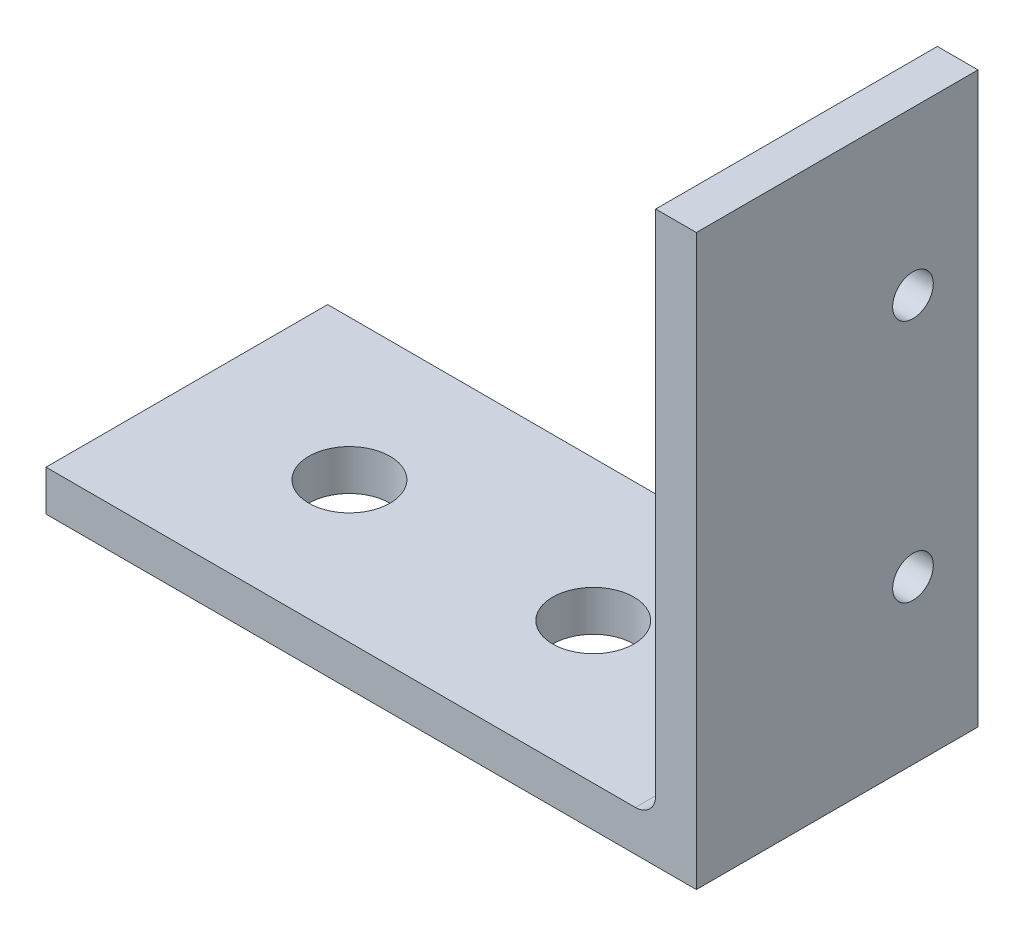
ISO-10303-21;
HEADER;
FILE_DESCRIPTION(('STEP AP214'),'2;1');
FILE_NAME('part.step','',(''),(''),'','','');
FILE_SCHEMA(('AUTOMOTIVE_DESIGN { 1 0 10303 214 1 1 1 1 }'));
ENDSEC;
DATA;
#1=APPLICATION_CONTEXT('core data for automotive mechanical design processes');
#2=APPLICATION_PROTOCOL_DEFINITION('international standard','automotive_design',2000,#1);
#3=PRODUCT_CONTEXT('',#1,'mechanical');
#4=PRODUCT('Part','Part','',(#3));
#5=PRODUCT_RELATED_PRODUCT_CATEGORY('part','',(#4));
#6=PRODUCT_DEFINITION_FORMATION('','',#4);
#7=PRODUCT_DEFINITION_CONTEXT('part definition',#1,'design');
#8=PRODUCT_DEFINITION('design','',#6,#7);
#9=PRODUCT_DEFINITION_SHAPE('','',#8);
#10=(LENGTH_UNIT() NAMED_UNIT(*) SI_UNIT(.MILLI.,.METRE.));
#11=(NAMED_UNIT(*) PLANE_ANGLE_UNIT() SI_UNIT($,.RADIAN.));
#12=(NAMED_UNIT(*) SI_UNIT($,.STERADIAN.) SOLID_ANGLE_UNIT());
#13=UNCERTAINTY_MEASURE_WITH_UNIT(LENGTH_MEASURE(1.E-05),#10,'distance_accuracy_value','');
#14=(GEOMETRIC_REPRESENTATION_CONTEXT(3) GLOBAL_UNCERTAINTY_ASSIGNED_CONTEXT((#13)) GLOBAL_UNIT_ASSIGNED_CONTEXT((#10,
#11,#12)) REPRESENTATION_CONTEXT('',''));
#15=CARTESIAN_POINT('',(0.,0.,0.));
#16=DIRECTION('',(0.,0.,1.));
#17=DIRECTION('',(1.,0.,0.));
#18=AXIS2_PLACEMENT_3D('',#15,#16,#17);
#19=CARTESIAN_POINT('',(-25.4,0.,11.));
#20=DIRECTION('',(1.,0.,0.));
#21=DIRECTION('',(0.,1.,0.));
#22=AXIS2_PLACEMENT_3D('',#19,#20,#21);
#23=PLANE('',#22);
#24=DIRECTION('',(0.,-1.,0.));
#25=VECTOR('',#24,1.);
#26=CARTESIAN_POINT('',(-25.4,0.,-11.));
#27=LINE('',#26,#25);
#28=CARTESIAN_POINT('',(-25.4,3.175,-11.));
#29=VERTEX_POINT('',#28);
#30=CARTESIAN_POINT('',(-25.4,0.,-11.));
#31=VERTEX_POINT('',#30);
#32=EDGE_CURVE('E116',#29,#31,#27,.T.);
#33=ORIENTED_EDGE('',*,*,#32,.T.);
#34=DIRECTION('',(0.,0.,-1.));
#35=VECTOR('',#34,1.);
#36=CARTESIAN_POINT('',(-25.4,0.,11.));
#37=LINE('',#36,#35);
#38=CARTESIAN_POINT('',(-25.4,0.,11.));
#39=VERTEX_POINT('',#38);
#40=EDGE_CURVE('E134',#39,#31,#37,.T.);
#41=ORIENTED_EDGE('',*,*,#40,.F.);
#42=DIRECTION('',(0.,-1.,0.));
#43=VECTOR('',#42,1.);
#44=CARTESIAN_POINT('',(-25.4,0.,11.));
#45=LINE('',#44,#43);
#46=CARTESIAN_POINT('',(-25.4,3.175,11.));
#47=VERTEX_POINT('',#46);
#48=EDGE_CURVE('E128',#47,#39,#45,.T.);
#49=ORIENTED_EDGE('',*,*,#48,.F.);
#50=DIRECTION('',(0.,0.,-1.));
#51=VECTOR('',#50,1.);
#52=CARTESIAN_POINT('',(-25.4,3.175,11.));
#53=LINE('',#52,#51);
#54=EDGE_CURVE('E110',#47,#29,#53,.T.);
#55=ORIENTED_EDGE('',*,*,#54,.T.);
#56=EDGE_LOOP('',(#33,#41,#49,#55));
#57=FACE_BOUND('',#56,.T.);
#58=ADVANCED_FACE('F33',(#57),#23,.F.);
#59=CARTESIAN_POINT('',(-25.4,0.,11.));
#60=DIRECTION('',(0.,1.,0.));
#61=DIRECTION('',(0.,0.,1.));
#62=AXIS2_PLACEMENT_3D('',#59,#60,#61);
#63=PLANE('',#62);
#64=CARTESIAN_POINT('',(-12.7,0.,0.));
#65=DIRECTION('',(0.,-1.,0.));
#66=DIRECTION('',(0.,0.,-1.));
#67=AXIS2_PLACEMENT_3D('',#64,#65,#66);
#68=CIRCLE('',#67,3.175);
#69=CARTESIAN_POINT('',(-12.7,0.,-3.175));
#70=VERTEX_POINT('',#69);
#71=EDGE_CURVE('E148',#70,#70,#68,.T.);
#72=ORIENTED_EDGE('',*,*,#71,.F.);
#73=EDGE_LOOP('',(#72));
#74=FACE_BOUND('',#73,.T.);
#75=CARTESIAN_POINT('',(6.35,0.,0.));
#76=DIRECTION('',(0.,-1.,0.));
#77=DIRECTION('',(0.,0.,-1.));
#78=AXIS2_PLACEMENT_3D('',#75,#76,#77);
#79=CIRCLE('',#78,3.175);
#80=CARTESIAN_POINT('',(6.35,0.,-3.175));
#81=VERTEX_POINT('',#80);
#82=EDGE_CURVE('E156',#81,#81,#79,.T.);
#83=ORIENTED_EDGE('',*,*,#82,.F.);
#84=EDGE_LOOP('',(#83));
#85=FACE_BOUND('',#84,.T.);
#86=DIRECTION('',(1.,0.,0.));
#87=VECTOR('',#86,1.);
#88=CARTESIAN_POINT('',(-25.4,0.,-11.));
#89=LINE('',#88,#87);
#90=CARTESIAN_POINT('',(25.4,0.,-11.));
#91=VERTEX_POINT('',#90);
#92=EDGE_CURVE('E119',#31,#91,#89,.T.);
#93=ORIENTED_EDGE('',*,*,#92,.T.);
#94=DIRECTION('',(0.,0.,-1.));
#95=VECTOR('',#94,1.);
#96=CARTESIAN_POINT('',(25.4,0.,11.));
#97=LINE('',#96,#95);
#98=CARTESIAN_POINT('',(25.4,0.,11.));
#99=VERTEX_POINT('',#98);
#100=EDGE_CURVE('E131',#99,#91,#97,.T.);
#101=ORIENTED_EDGE('',*,*,#100,.F.);
#102=DIRECTION('',(1.,0.,0.));
#103=VECTOR('',#102,1.);
#104=CARTESIAN_POINT('',(-25.4,0.,11.));
#105=LINE('',#104,#103);
#106=EDGE_CURVE('E112',#39,#99,#105,.T.);
#107=ORIENTED_EDGE('',*,*,#106,.F.);
#108=ORIENTED_EDGE('',*,*,#40,.T.);
#109=EDGE_LOOP('',(#93,#101,#107,#108));
#110=FACE_BOUND('',#109,.T.);
#111=ADVANCED_FACE('F175',(#74,#85,#110),#63,.F.);
#112=CARTESIAN_POINT('',(25.4,0.,11.));
#113=DIRECTION('',(-1.,0.,0.));
#114=DIRECTION('',(0.,0.,1.));
#115=AXIS2_PLACEMENT_3D('',#112,#113,#114);
#116=PLANE('',#115);
#117=CARTESIAN_POINT('',(25.4,12.6999999999999,-5.92));
#118=DIRECTION('',(1.,0.,0.));
#119=DIRECTION('',(0.,0.,-1.));
#120=AXIS2_PLACEMENT_3D('',#117,#118,#119);
#121=CIRCLE('',#120,1.5875);
#122=CARTESIAN_POINT('',(25.4,12.6999999999999,-7.5075));
#123=VERTEX_POINT('',#122);
#124=EDGE_CURVE('E152',#123,#123,#121,.T.);
#125=ORIENTED_EDGE('',*,*,#124,.F.);
#126=EDGE_LOOP('',(#125));
#127=FACE_BOUND('',#126,.T.);
#128=CARTESIAN_POINT('',(25.4,31.75,-5.92));
#129=DIRECTION('',(1.,0.,0.));
#130=DIRECTION('',(0.,0.,-1.));
#131=AXIS2_PLACEMENT_3D('',#128,#129,#130);
#132=CIRCLE('',#131,1.5875);
#133=CARTESIAN_POINT('',(25.4,31.75,-7.5075));
#134=VERTEX_POINT('',#133);
#135=EDGE_CURVE('E158',#134,#134,#132,.T.);
#136=ORIENTED_EDGE('',*,*,#135,.F.);
#137=EDGE_LOOP('',(#136));
#138=FACE_BOUND('',#137,.T.);
#139=DIRECTION('',(0.,1.,0.));
#140=VECTOR('',#139,1.);
#141=CARTESIAN_POINT('',(25.4,0.,-11.));
#142=LINE('',#141,#140);
#143=CARTESIAN_POINT('',(25.4,44.45,-11.));
#144=VERTEX_POINT('',#143);
#145=EDGE_CURVE('E121',#91,#144,#142,.T.);
#146=ORIENTED_EDGE('',*,*,#145,.T.);
#147=DIRECTION('',(0.,0.,1.));
#148=VECTOR('',#147,1.);
#149=CARTESIAN_POINT('',(25.4,44.45,11.));
#150=LINE('',#149,#148);
#151=CARTESIAN_POINT('',(25.4,44.45,11.));
#152=VERTEX_POINT('',#151);
#153=EDGE_CURVE('E50',#144,#152,#150,.T.);
#154=ORIENTED_EDGE('',*,*,#153,.T.);
#155=DIRECTION('',(0.,1.,0.));
#156=VECTOR('',#155,1.);
#157=CARTESIAN_POINT('',(25.4,0.,11.));
#158=LINE('',#157,#156);
#159=EDGE_CURVE('E101',#99,#152,#158,.T.);
#160=ORIENTED_EDGE('',*,*,#159,.F.);
#161=ORIENTED_EDGE('',*,*,#100,.T.);
#162=EDGE_LOOP('',(#146,#154,#160,#161));
#163=FACE_BOUND('',#162,.T.);
#164=ADVANCED_FACE('F178',(#127,#138,#163),#116,.F.);
#165=CARTESIAN_POINT('',(22.225,50.8,11.));
#166=DIRECTION('',(1.,0.,0.));
#167=DIRECTION('',(0.,1.,0.));
#168=AXIS2_PLACEMENT_3D('',#165,#166,#167);
#169=PLANE('',#168);
#170=CARTESIAN_POINT('',(22.225,12.6999999999999,-5.92));
#171=DIRECTION('',(1.,0.,0.));
#172=DIRECTION('',(0.,1.,0.));
#173=AXIS2_PLACEMENT_3D('',#170,#171,#172);
#174=CIRCLE('',#173,1.5875);
#175=CARTESIAN_POINT('',(22.225,14.2874999999999,-5.92));
#176=VERTEX_POINT('',#175);
#177=EDGE_CURVE('E37',#176,#176,#174,.T.);
#178=ORIENTED_EDGE('',*,*,#177,.T.);
#179=EDGE_LOOP('',(#178));
#180=FACE_BOUND('',#179,.T.);
#181=CARTESIAN_POINT('',(22.225,31.75,-5.92));
#182=DIRECTION('',(1.,0.,0.));
#183=DIRECTION('',(0.,1.,0.));
#184=AXIS2_PLACEMENT_3D('',#181,#182,#183);
#185=CIRCLE('',#184,1.5875);
#186=CARTESIAN_POINT('',(22.225,33.3375,-5.92));
#187=VERTEX_POINT('',#186);
#188=EDGE_CURVE('E150',#187,#187,#185,.T.);
#189=ORIENTED_EDGE('',*,*,#188,.T.);
#190=EDGE_LOOP('',(#189));
#191=FACE_BOUND('',#190,.T.);
#192=DIRECTION('',(0.,-1.,0.));
#193=VECTOR('',#192,1.);
#194=CARTESIAN_POINT('',(22.225,50.8,11.));
#195=LINE('',#194,#193);
#196=CARTESIAN_POINT('',(22.225,44.45,11.));
#197=VERTEX_POINT('',#196);
#198=CARTESIAN_POINT('',(22.225,4.7625,11.));
#199=VERTEX_POINT('',#198);
#200=EDGE_CURVE('E57',#197,#199,#195,.T.);
#201=ORIENTED_EDGE('',*,*,#200,.F.);
#202=DIRECTION('',(0.,0.,-1.));
#203=VECTOR('',#202,1.);
#204=CARTESIAN_POINT('',(22.225,44.45,11.));
#205=LINE('',#204,#203);
#206=CARTESIAN_POINT('',(22.225,44.45,-11.));
#207=VERTEX_POINT('',#206);
#208=EDGE_CURVE('E92',#197,#207,#205,.T.);
#209=ORIENTED_EDGE('',*,*,#208,.T.);
#210=DIRECTION('',(0.,-1.,0.));
#211=VECTOR('',#210,1.);
#212=CARTESIAN_POINT('',(22.225,50.8,-11.));
#213=LINE('',#212,#211);
#214=CARTESIAN_POINT('',(22.225,4.7625,-11.));
#215=VERTEX_POINT('',#214);
#216=EDGE_CURVE('E124',#207,#215,#213,.T.);
#217=ORIENTED_EDGE('',*,*,#216,.T.);
#218=DIRECTION('',(0.,0.,-1.));
#219=VECTOR('',#218,1.);
#220=CARTESIAN_POINT('',(22.225,4.76249999999999,11.));
#221=LINE('',#220,#219);
#222=EDGE_CURVE('E106',#215,#199,#221,.F.);
#223=ORIENTED_EDGE('',*,*,#222,.T.);
#224=EDGE_LOOP('',(#201,#209,#217,#223));
#225=FACE_BOUND('',#224,.T.);
#226=ADVANCED_FACE('F104',(#180,#191,#225),#169,.F.);
#227=CARTESIAN_POINT('',(22.225,3.17499999999999,11.));
#228=DIRECTION('',(0.,-1.,0.));
#229=DIRECTION('',(1.,0.,0.));
#230=AXIS2_PLACEMENT_3D('',#227,#228,#229);
#231=PLANE('',#230);
#232=CARTESIAN_POINT('',(-12.7,3.175,0.));
#233=DIRECTION('',(0.,-1.,0.));
#234=DIRECTION('',(1.,0.,0.));
#235=AXIS2_PLACEMENT_3D('',#232,#233,#234);
#236=CIRCLE('',#235,3.175);
#237=CARTESIAN_POINT('',(-9.525,3.175,0.));
#238=VERTEX_POINT('',#237);
#239=EDGE_CURVE('E102',#238,#238,#236,.T.);
#240=ORIENTED_EDGE('',*,*,#239,.T.);
#241=EDGE_LOOP('',(#240));
#242=FACE_BOUND('',#241,.T.);
#243=CARTESIAN_POINT('',(6.35,3.175,0.));
#244=DIRECTION('',(0.,-1.,0.));
#245=DIRECTION('',(1.,0.,0.));
#246=AXIS2_PLACEMENT_3D('',#243,#244,#245);
#247=CIRCLE('',#246,3.175);
#248=CARTESIAN_POINT('',(9.525,3.175,0.));
#249=VERTEX_POINT('',#248);
#250=EDGE_CURVE('E145',#249,#249,#247,.T.);
#251=ORIENTED_EDGE('',*,*,#250,.T.);
#252=EDGE_LOOP('',(#251));
#253=FACE_BOUND('',#252,.T.);
#254=DIRECTION('',(-1.,0.,0.));
#255=VECTOR('',#254,1.);
#256=CARTESIAN_POINT('',(22.225,3.17499999999999,11.));
#257=LINE('',#256,#255);
#258=CARTESIAN_POINT('',(20.6375,3.17499999999999,11.));
#259=VERTEX_POINT('',#258);
#260=EDGE_CURVE('E108',#259,#47,#257,.T.);
#261=ORIENTED_EDGE('',*,*,#260,.F.);
#262=DIRECTION('',(0.,0.,-1.));
#263=VECTOR('',#262,1.);
#264=CARTESIAN_POINT('',(20.6375,3.17499999999999,-11.));
#265=LINE('',#264,#263);
#266=CARTESIAN_POINT('',(20.6375,3.17499999999999,-11.));
#267=VERTEX_POINT('',#266);
#268=EDGE_CURVE('E137',#259,#267,#265,.T.);
#269=ORIENTED_EDGE('',*,*,#268,.T.);
#270=DIRECTION('',(-1.,0.,0.));
#271=VECTOR('',#270,1.);
#272=CARTESIAN_POINT('',(22.225,3.17499999999999,-11.));
#273=LINE('',#272,#271);
#274=EDGE_CURVE('E126',#267,#29,#273,.T.);
#275=ORIENTED_EDGE('',*,*,#274,.T.);
#276=ORIENTED_EDGE('',*,*,#54,.F.);
#277=EDGE_LOOP('',(#261,#269,#275,#276));
#278=FACE_BOUND('',#277,.T.);
#279=ADVANCED_FACE('F188',(#242,#253,#278),#231,.F.);
#280=CARTESIAN_POINT('',(-25.4,3.175,11.));
#281=DIRECTION('',(0.,0.,1.));
#282=DIRECTION('',(1.,0.,0.));
#283=AXIS2_PLACEMENT_3D('',#280,#281,#282);
#284=PLANE('',#283);
#285=DIRECTION('',(1.,0.,0.));
#286=VECTOR('',#285,1.);
#287=CARTESIAN_POINT('',(6.05907768448333,44.45,11.));
#288=LINE('',#287,#286);
#289=EDGE_CURVE('E94',#197,#152,#288,.T.);
#290=ORIENTED_EDGE('',*,*,#289,.F.);
#291=ORIENTED_EDGE('',*,*,#200,.T.);
#292=CARTESIAN_POINT('',(20.6375,4.76249999999999,11.));
#293=DIRECTION('',(0.,0.,1.));
#294=DIRECTION('',(1.,0.,0.));
#295=AXIS2_PLACEMENT_3D('',#292,#293,#294);
#296=CIRCLE('',#295,1.5875);
#297=EDGE_CURVE('E42',#199,#259,#296,.F.);
#298=ORIENTED_EDGE('',*,*,#297,.T.);
#299=ORIENTED_EDGE('',*,*,#260,.T.);
#300=ORIENTED_EDGE('',*,*,#48,.T.);
#301=ORIENTED_EDGE('',*,*,#106,.T.);
#302=ORIENTED_EDGE('',*,*,#159,.T.);
#303=EDGE_LOOP('',(#290,#291,#298,#299,#300,#301,#302));
#304=FACE_BOUND('',#303,.T.);
#305=ADVANCED_FACE('F99',(#304),#284,.T.);
#306=CARTESIAN_POINT('',(-25.4,3.175,-11.));
#307=DIRECTION('',(0.,0.,1.));
#308=DIRECTION('',(1.,0.,0.));
#309=AXIS2_PLACEMENT_3D('',#306,#307,#308);
#310=PLANE('',#309);
#311=ORIENTED_EDGE('',*,*,#216,.F.);
#312=DIRECTION('',(1.,0.,0.));
#313=VECTOR('',#312,1.);
#314=CARTESIAN_POINT('',(-25.4,44.45,-11.));
#315=LINE('',#314,#313);
#316=EDGE_CURVE('E11',#207,#144,#315,.T.);
#317=ORIENTED_EDGE('',*,*,#316,.T.);
#318=ORIENTED_EDGE('',*,*,#145,.F.);
#319=ORIENTED_EDGE('',*,*,#92,.F.);
#320=ORIENTED_EDGE('',*,*,#32,.F.);
#321=ORIENTED_EDGE('',*,*,#274,.F.);
#322=CARTESIAN_POINT('',(20.6375,4.76249999999999,-11.));
#323=DIRECTION('',(0.,0.,1.));
#324=DIRECTION('',(1.,0.,0.));
#325=AXIS2_PLACEMENT_3D('',#322,#323,#324);
#326=CIRCLE('',#325,1.5875);
#327=EDGE_CURVE('E141',#267,#215,#326,.T.);
#328=ORIENTED_EDGE('',*,*,#327,.T.);
#329=EDGE_LOOP('',(#311,#317,#318,#319,#320,#321,#328));
#330=FACE_BOUND('',#329,.T.);
#331=ADVANCED_FACE('F180',(#330),#310,.F.);
#332=CARTESIAN_POINT('',(20.6375,4.76249999999999,11.));
#333=DIRECTION('',(0.,0.,1.));
#334=DIRECTION('',(1.,0.,0.));
#335=AXIS2_PLACEMENT_3D('',#332,#333,#334);
#336=CYLINDRICAL_SURFACE('',#335,1.5875);
#337=ORIENTED_EDGE('',*,*,#297,.F.);
#338=ORIENTED_EDGE('',*,*,#222,.F.);
#339=ORIENTED_EDGE('',*,*,#327,.F.);
#340=ORIENTED_EDGE('',*,*,#268,.F.);
#341=EDGE_LOOP('',(#337,#338,#339,#340));
#342=FACE_BOUND('',#341,.T.);
#343=ADVANCED_FACE('F35',(#342),#336,.F.);
#344=CARTESIAN_POINT('',(6.05907768448333,44.45,-11.));
#345=DIRECTION('',(0.,-1.,0.));
#346=DIRECTION('',(0.,0.,-1.));
#347=AXIS2_PLACEMENT_3D('',#344,#345,#346);
#348=PLANE('',#347);
#349=ORIENTED_EDGE('',*,*,#316,.F.);
#350=ORIENTED_EDGE('',*,*,#208,.F.);
#351=ORIENTED_EDGE('',*,*,#289,.T.);
#352=ORIENTED_EDGE('',*,*,#153,.F.);
#353=EDGE_LOOP('',(#349,#350,#351,#352));
#354=FACE_BOUND('',#353,.T.);
#355=ADVANCED_FACE('F93',(#354),#348,.F.);
#356=CARTESIAN_POINT('',(6.35,44.45,0.));
#357=DIRECTION('',(0.,-1.,0.));
#358=DIRECTION('',(0.,0.,-1.));
#359=AXIS2_PLACEMENT_3D('',#356,#357,#358);
#360=CYLINDRICAL_SURFACE('',#359,3.175);
#361=ORIENTED_EDGE('',*,*,#82,.T.);
#362=EDGE_LOOP('',(#361));
#363=FACE_BOUND('',#362,.T.);
#364=ORIENTED_EDGE('',*,*,#250,.F.);
#365=EDGE_LOOP('',(#364));
#366=FACE_BOUND('',#365,.T.);
#367=ADVANCED_FACE('F212',(#363,#366),#360,.F.);
#368=CARTESIAN_POINT('',(-12.7,44.45,0.));
#369=DIRECTION('',(0.,-1.,0.));
#370=DIRECTION('',(0.,0.,-1.));
#371=AXIS2_PLACEMENT_3D('',#368,#369,#370);
#372=CYLINDRICAL_SURFACE('',#371,3.175);
#373=ORIENTED_EDGE('',*,*,#71,.T.);
#374=EDGE_LOOP('',(#373));
#375=FACE_BOUND('',#374,.T.);
#376=ORIENTED_EDGE('',*,*,#239,.F.);
#377=EDGE_LOOP('',(#376));
#378=FACE_BOUND('',#377,.T.);
#379=ADVANCED_FACE('F215',(#375,#378),#372,.F.);
#380=CARTESIAN_POINT('',(-25.4,31.75,-5.92));
#381=DIRECTION('',(1.,0.,0.));
#382=DIRECTION('',(0.,0.,-1.));
#383=AXIS2_PLACEMENT_3D('',#380,#381,#382);
#384=CYLINDRICAL_SURFACE('',#383,1.5875);
#385=ORIENTED_EDGE('',*,*,#135,.T.);
#386=EDGE_LOOP('',(#385));
#387=FACE_BOUND('',#386,.T.);
#388=ORIENTED_EDGE('',*,*,#188,.F.);
#389=EDGE_LOOP('',(#388));
#390=FACE_BOUND('',#389,.T.);
#391=ADVANCED_FACE('F219',(#387,#390),#384,.F.);
#392=CARTESIAN_POINT('',(-25.4,12.6999999999999,-5.92));
#393=DIRECTION('',(1.,0.,0.));
#394=DIRECTION('',(0.,0.,-1.));
#395=AXIS2_PLACEMENT_3D('',#392,#393,#394);
#396=CYLINDRICAL_SURFACE('',#395,1.5875);
#397=ORIENTED_EDGE('',*,*,#124,.T.);
#398=EDGE_LOOP('',(#397));
#399=FACE_BOUND('',#398,.T.);
#400=ORIENTED_EDGE('',*,*,#177,.F.);
#401=EDGE_LOOP('',(#400));
#402=FACE_BOUND('',#401,.T.);
#403=ADVANCED_FACE('F223',(#399,#402),#396,.F.);
#404=CLOSED_SHELL('',(#58,#111,#164,#226,#279,#305,#331,#343,#355,#367,#379,#391,#403));
#405=MANIFOLD_SOLID_BREP('B2',#404);
#406=ADVANCED_BREP_SHAPE_REPRESENTATION('',(#18,#405),#14);
#407=SHAPE_DEFINITION_REPRESENTATION(#9,#406);
ENDSEC;
END-ISO-10303-21;
